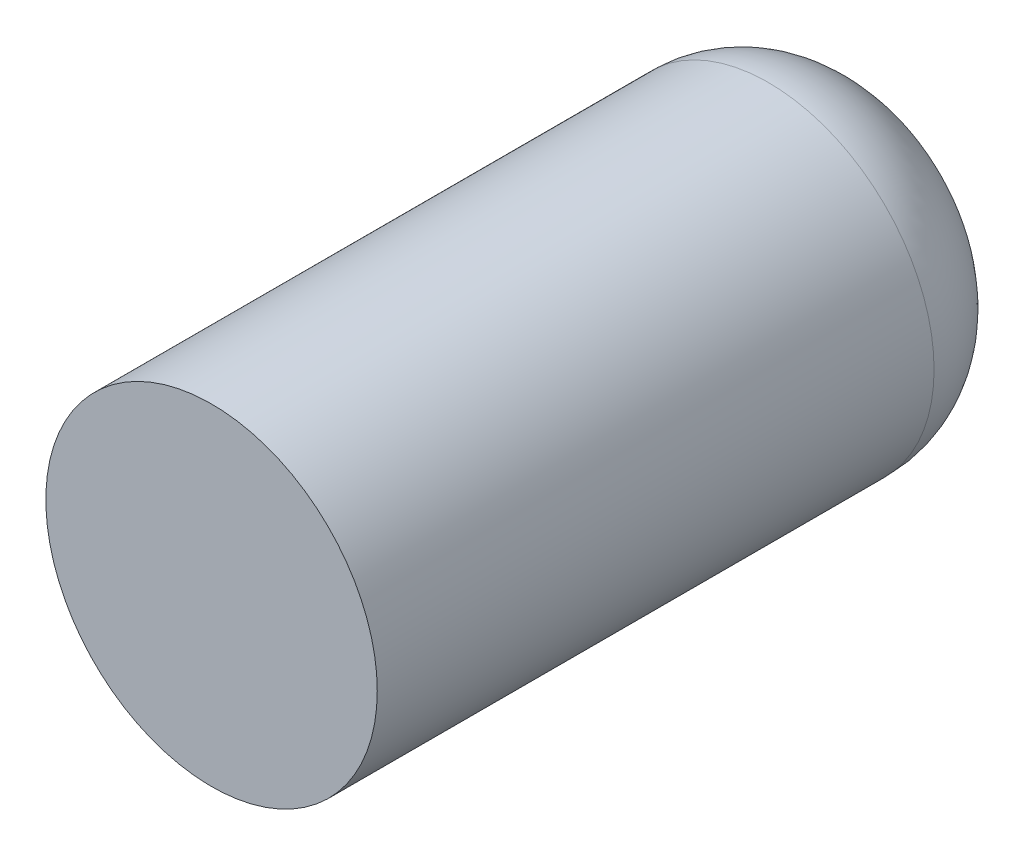
ISO-10303-21;
HEADER;
FILE_DESCRIPTION(('STEP AP214'),'2;1');
FILE_NAME('part.step','',(''),(''),'','','');
FILE_SCHEMA(('AUTOMOTIVE_DESIGN { 1 0 10303 214 1 1 1 1 }'));
ENDSEC;
DATA;
#1=APPLICATION_CONTEXT('core data for automotive mechanical design processes');
#2=APPLICATION_PROTOCOL_DEFINITION('international standard','automotive_design',2000,#1);
#3=PRODUCT_CONTEXT('',#1,'mechanical');
#4=PRODUCT('Part','Part','',(#3));
#5=PRODUCT_RELATED_PRODUCT_CATEGORY('part','',(#4));
#6=PRODUCT_DEFINITION_FORMATION('','',#4);
#7=PRODUCT_DEFINITION_CONTEXT('part definition',#1,'design');
#8=PRODUCT_DEFINITION('design','',#6,#7);
#9=PRODUCT_DEFINITION_SHAPE('','',#8);
#10=(LENGTH_UNIT() NAMED_UNIT(*) SI_UNIT(.MILLI.,.METRE.));
#11=(NAMED_UNIT(*) PLANE_ANGLE_UNIT() SI_UNIT($,.RADIAN.));
#12=(NAMED_UNIT(*) SI_UNIT($,.STERADIAN.) SOLID_ANGLE_UNIT());
#13=UNCERTAINTY_MEASURE_WITH_UNIT(LENGTH_MEASURE(1.E-05),#10,'distance_accuracy_value','');
#14=(GEOMETRIC_REPRESENTATION_CONTEXT(3) GLOBAL_UNCERTAINTY_ASSIGNED_CONTEXT((#13)) GLOBAL_UNIT_ASSIGNED_CONTEXT((#10,
#11,#12)) REPRESENTATION_CONTEXT('',''));
#15=CARTESIAN_POINT('',(0.,0.,0.));
#16=DIRECTION('',(0.,0.,1.));
#17=DIRECTION('',(1.,0.,0.));
#18=AXIS2_PLACEMENT_3D('',#15,#16,#17);
#19=CARTESIAN_POINT('',(0.,0.,31.75));
#20=DIRECTION('',(0.,0.,-1.));
#21=DIRECTION('',(-1.,0.,0.));
#22=AXIS2_PLACEMENT_3D('',#19,#20,#21);
#23=CYLINDRICAL_SURFACE('',#22,7.9375);
#24=CARTESIAN_POINT('',(0.,0.,5.08));
#25=DIRECTION('',(0.,0.,1.));
#26=DIRECTION('',(1.,0.,0.));
#27=AXIS2_PLACEMENT_3D('',#24,#25,#26);
#28=CIRCLE('',#27,7.9375);
#29=CARTESIAN_POINT('',(7.9375,0.,5.08));
#30=VERTEX_POINT('',#29);
#31=EDGE_CURVE('E38',#30,#30,#28,.T.);
#32=ORIENTED_EDGE('',*,*,#31,.T.);
#33=EDGE_LOOP('',(#32));
#34=FACE_BOUND('',#33,.T.);
#35=CARTESIAN_POINT('',(0.,0.,31.75));
#36=DIRECTION('',(0.,0.,1.));
#37=DIRECTION('',(1.,0.,0.));
#38=AXIS2_PLACEMENT_3D('',#35,#36,#37);
#39=CIRCLE('',#38,7.9375);
#40=CARTESIAN_POINT('',(7.9375,0.,31.75));
#41=VERTEX_POINT('',#40);
#42=EDGE_CURVE('E42',#41,#41,#39,.T.);
#43=ORIENTED_EDGE('',*,*,#42,.F.);
#44=EDGE_LOOP('',(#43));
#45=FACE_BOUND('',#44,.T.);
#46=ADVANCED_FACE('F31',(#34,#45),#23,.T.);
#47=CARTESIAN_POINT('',(0.,0.,31.75));
#48=DIRECTION('',(0.,0.,1.));
#49=DIRECTION('',(1.,0.,0.));
#50=AXIS2_PLACEMENT_3D('',#47,#48,#49);
#51=PLANE('',#50);
#52=ORIENTED_EDGE('',*,*,#42,.T.);
#53=EDGE_LOOP('',(#52));
#54=FACE_BOUND('',#53,.T.);
#55=ADVANCED_FACE('F49',(#54),#51,.T.);
#56=CARTESIAN_POINT('',(0.,0.,0.));
#57=DIRECTION('',(0.,0.,1.));
#58=DIRECTION('',(1.,0.,0.));
#59=AXIS2_PLACEMENT_3D('',#56,#57,#58);
#60=PLANE('',#59);
#61=CARTESIAN_POINT('',(0.,0.,0.));
#62=DIRECTION('',(0.,0.,1.));
#63=DIRECTION('',(1.,0.,0.));
#64=AXIS2_PLACEMENT_3D('',#61,#62,#63);
#65=CIRCLE('',#64,2.8575);
#66=CARTESIAN_POINT('',(2.8575,0.,0.));
#67=VERTEX_POINT('',#66);
#68=EDGE_CURVE('E10',#67,#67,#65,.F.);
#69=ORIENTED_EDGE('',*,*,#68,.T.);
#70=EDGE_LOOP('',(#69));
#71=FACE_BOUND('',#70,.T.);
#72=ADVANCED_FACE('F55',(#71),#60,.F.);
#73=CARTESIAN_POINT('',(0.,0.,5.08));
#74=DIRECTION('',(0.,0.,1.));
#75=DIRECTION('',(1.,0.,0.));
#76=AXIS2_PLACEMENT_3D('',#73,#74,#75);
#77=DEGENERATE_TOROIDAL_SURFACE('',#76,2.8575,5.08,.T.);
#78=ORIENTED_EDGE('',*,*,#68,.F.);
#79=EDGE_LOOP('',(#78));
#80=FACE_BOUND('',#79,.T.);
#81=ORIENTED_EDGE('',*,*,#31,.F.);
#82=EDGE_LOOP('',(#81));
#83=FACE_BOUND('',#82,.T.);
#84=ADVANCED_FACE('F33',(#80,#83),#77,.T.);
#85=CLOSED_SHELL('',(#46,#55,#72,#84));
#86=MANIFOLD_SOLID_BREP('B2',#85);
#87=ADVANCED_BREP_SHAPE_REPRESENTATION('',(#18,#86),#14);
#88=SHAPE_DEFINITION_REPRESENTATION(#9,#87);
ENDSEC;
END-ISO-10303-21;
